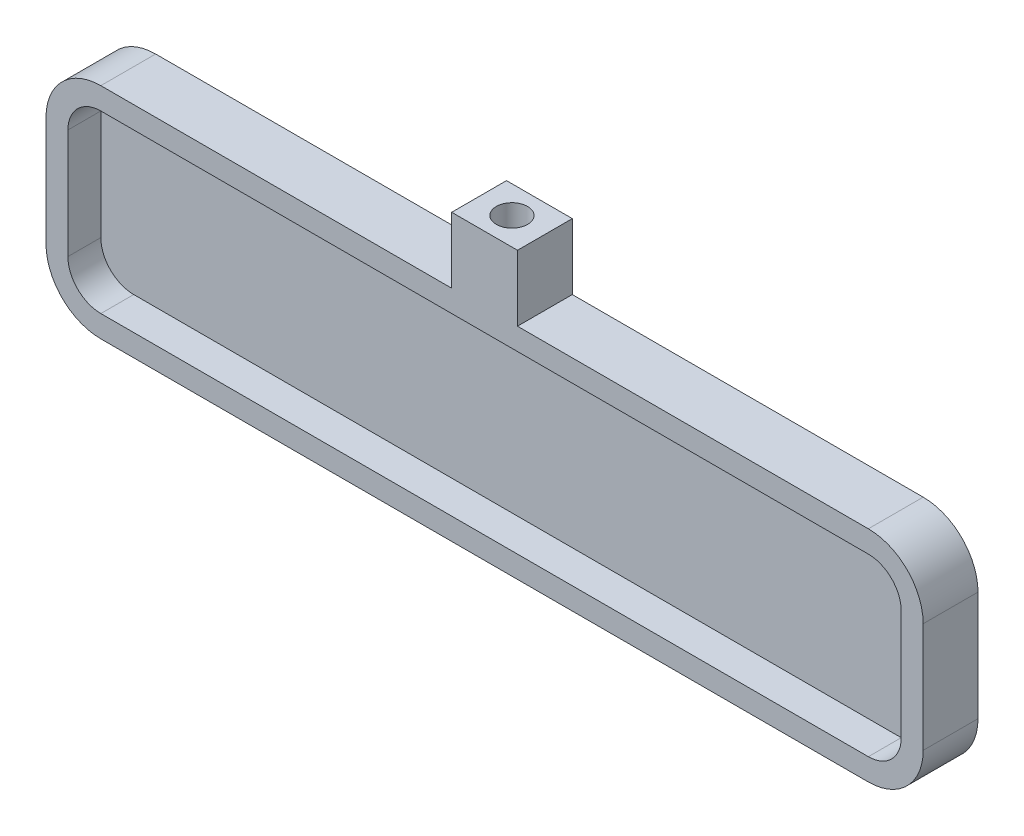
ISO-10303-21;
HEADER;
FILE_DESCRIPTION(('STEP AP214'),'2;1');
FILE_NAME('part.step','',(''),(''),'','','');
FILE_SCHEMA(('AUTOMOTIVE_DESIGN { 1 0 10303 214 1 1 1 1 }'));
ENDSEC;
DATA;
#1=APPLICATION_CONTEXT('core data for automotive mechanical design processes');
#2=APPLICATION_PROTOCOL_DEFINITION('international standard','automotive_design',2000,#1);
#3=PRODUCT_CONTEXT('',#1,'mechanical');
#4=PRODUCT('Part','Part','',(#3));
#5=PRODUCT_RELATED_PRODUCT_CATEGORY('part','',(#4));
#6=PRODUCT_DEFINITION_FORMATION('','',#4);
#7=PRODUCT_DEFINITION_CONTEXT('part definition',#1,'design');
#8=PRODUCT_DEFINITION('design','',#6,#7);
#9=PRODUCT_DEFINITION_SHAPE('','',#8);
#10=(LENGTH_UNIT() NAMED_UNIT(*) SI_UNIT(.MILLI.,.METRE.));
#11=(NAMED_UNIT(*) PLANE_ANGLE_UNIT() SI_UNIT($,.RADIAN.));
#12=(NAMED_UNIT(*) SI_UNIT($,.STERADIAN.) SOLID_ANGLE_UNIT());
#13=UNCERTAINTY_MEASURE_WITH_UNIT(LENGTH_MEASURE(1.E-05),#10,'distance_accuracy_value','');
#14=(GEOMETRIC_REPRESENTATION_CONTEXT(3) GLOBAL_UNCERTAINTY_ASSIGNED_CONTEXT((#13)) GLOBAL_UNIT_ASSIGNED_CONTEXT((#10,
#11,#12)) REPRESENTATION_CONTEXT('',''));
#15=CARTESIAN_POINT('',(0.,0.,0.));
#16=DIRECTION('',(0.,0.,1.));
#17=DIRECTION('',(1.,0.,0.));
#18=AXIS2_PLACEMENT_3D('',#15,#16,#17);
#19=CARTESIAN_POINT('',(-40.,10.,5.));
#20=DIRECTION('',(0.,-1.,0.));
#21=DIRECTION('',(0.,0.,-1.));
#22=AXIS2_PLACEMENT_3D('',#19,#20,#21);
#23=PLANE('',#22);
#24=DIRECTION('',(0.,0.,1.));
#25=VECTOR('',#24,1.);
#26=CARTESIAN_POINT('',(-3.,10.,5.));
#27=LINE('',#26,#25);
#28=CARTESIAN_POINT('',(-3.,10.,0.));
#29=VERTEX_POINT('',#28);
#30=CARTESIAN_POINT('',(-3.,10.,5.));
#31=VERTEX_POINT('',#30);
#32=EDGE_CURVE('E196',#29,#31,#27,.T.);
#33=ORIENTED_EDGE('',*,*,#32,.F.);
#34=DIRECTION('',(-1.,0.,0.));
#35=VECTOR('',#34,1.);
#36=CARTESIAN_POINT('',(-40.,10.,0.));
#37=LINE('',#36,#35);
#38=CARTESIAN_POINT('',(-35.,10.,0.));
#39=VERTEX_POINT('',#38);
#40=EDGE_CURVE('E277',#29,#39,#37,.T.);
#41=ORIENTED_EDGE('',*,*,#40,.T.);
#42=DIRECTION('',(0.,0.,-1.));
#43=VECTOR('',#42,1.);
#44=CARTESIAN_POINT('',(-35.,10.,5.));
#45=LINE('',#44,#43);
#46=CARTESIAN_POINT('',(-35.,10.,5.));
#47=VERTEX_POINT('',#46);
#48=EDGE_CURVE('E274',#39,#47,#45,.F.);
#49=ORIENTED_EDGE('',*,*,#48,.T.);
#50=DIRECTION('',(-1.,0.,0.));
#51=VECTOR('',#50,1.);
#52=CARTESIAN_POINT('',(-40.,10.,5.));
#53=LINE('',#52,#51);
#54=EDGE_CURVE('E51',#31,#47,#53,.T.);
#55=ORIENTED_EDGE('',*,*,#54,.F.);
#56=EDGE_LOOP('',(#33,#41,#49,#55));
#57=FACE_BOUND('',#56,.T.);
#58=ADVANCED_FACE('F36',(#57),#23,.F.);
#59=DIRECTION('',(0.,0.,-1.));
#60=VECTOR('',#59,1.);
#61=CARTESIAN_POINT('',(3.,10.,5.));
#62=LINE('',#61,#60);
#63=CARTESIAN_POINT('',(3.,10.,5.));
#64=VERTEX_POINT('',#63);
#65=CARTESIAN_POINT('',(3.,10.,0.));
#66=VERTEX_POINT('',#65);
#67=EDGE_CURVE('E59',#64,#66,#62,.T.);
#68=ORIENTED_EDGE('',*,*,#67,.F.);
#69=CARTESIAN_POINT('',(35.,10.,5.));
#70=VERTEX_POINT('',#69);
#71=EDGE_CURVE('E266',#70,#64,#53,.T.);
#72=ORIENTED_EDGE('',*,*,#71,.F.);
#73=DIRECTION('',(0.,0.,-1.));
#74=VECTOR('',#73,1.);
#75=CARTESIAN_POINT('',(35.,10.,5.));
#76=LINE('',#75,#74);
#77=CARTESIAN_POINT('',(35.,10.,0.));
#78=VERTEX_POINT('',#77);
#79=EDGE_CURVE('E286',#70,#78,#76,.T.);
#80=ORIENTED_EDGE('',*,*,#79,.T.);
#81=EDGE_CURVE('E278',#78,#66,#37,.T.);
#82=ORIENTED_EDGE('',*,*,#81,.T.);
#83=EDGE_LOOP('',(#68,#72,#80,#82));
#84=FACE_BOUND('',#83,.T.);
#85=ADVANCED_FACE('F351',(#84),#23,.F.);
#86=CARTESIAN_POINT('',(40.,10.,5.));
#87=DIRECTION('',(-1.,0.,0.));
#88=DIRECTION('',(0.,0.,1.));
#89=AXIS2_PLACEMENT_3D('',#86,#87,#88);
#90=PLANE('',#89);
#91=DIRECTION('',(0.,1.,0.));
#92=VECTOR('',#91,1.);
#93=CARTESIAN_POINT('',(40.,10.,0.));
#94=LINE('',#93,#92);
#95=CARTESIAN_POINT('',(40.,-5.,0.));
#96=VERTEX_POINT('',#95);
#97=CARTESIAN_POINT('',(40.,5.,0.));
#98=VERTEX_POINT('',#97);
#99=EDGE_CURVE('E241',#96,#98,#94,.T.);
#100=ORIENTED_EDGE('',*,*,#99,.T.);
#101=DIRECTION('',(0.,0.,-1.));
#102=VECTOR('',#101,1.);
#103=CARTESIAN_POINT('',(40.,5.,5.));
#104=LINE('',#103,#102);
#105=CARTESIAN_POINT('',(40.,5.,5.));
#106=VERTEX_POINT('',#105);
#107=EDGE_CURVE('E301',#98,#106,#104,.F.);
#108=ORIENTED_EDGE('',*,*,#107,.T.);
#109=DIRECTION('',(0.,1.,0.));
#110=VECTOR('',#109,1.);
#111=CARTESIAN_POINT('',(40.,10.,5.));
#112=LINE('',#111,#110);
#113=CARTESIAN_POINT('',(40.,-5.,5.));
#114=VERTEX_POINT('',#113);
#115=EDGE_CURVE('E263',#114,#106,#112,.T.);
#116=ORIENTED_EDGE('',*,*,#115,.F.);
#117=DIRECTION('',(0.,0.,-1.));
#118=VECTOR('',#117,1.);
#119=CARTESIAN_POINT('',(40.,-5.,5.));
#120=LINE('',#119,#118);
#121=EDGE_CURVE('E298',#114,#96,#120,.T.);
#122=ORIENTED_EDGE('',*,*,#121,.T.);
#123=EDGE_LOOP('',(#100,#108,#116,#122));
#124=FACE_BOUND('',#123,.T.);
#125=ADVANCED_FACE('F344',(#124),#90,.F.);
#126=CARTESIAN_POINT('',(-40.,10.,5.));
#127=DIRECTION('',(1.,0.,0.));
#128=DIRECTION('',(0.,0.,-1.));
#129=AXIS2_PLACEMENT_3D('',#126,#127,#128);
#130=PLANE('',#129);
#131=DIRECTION('',(0.,-1.,0.));
#132=VECTOR('',#131,1.);
#133=CARTESIAN_POINT('',(-40.,10.,0.));
#134=LINE('',#133,#132);
#135=CARTESIAN_POINT('',(-40.,5.,0.));
#136=VERTEX_POINT('',#135);
#137=CARTESIAN_POINT('',(-40.,-5.,0.));
#138=VERTEX_POINT('',#137);
#139=EDGE_CURVE('E280',#136,#138,#134,.T.);
#140=ORIENTED_EDGE('',*,*,#139,.T.);
#141=DIRECTION('',(0.,0.,-1.));
#142=VECTOR('',#141,1.);
#143=CARTESIAN_POINT('',(-40.,-5.,5.));
#144=LINE('',#143,#142);
#145=CARTESIAN_POINT('',(-40.,-5.,5.));
#146=VERTEX_POINT('',#145);
#147=EDGE_CURVE('E11',#138,#146,#144,.F.);
#148=ORIENTED_EDGE('',*,*,#147,.T.);
#149=DIRECTION('',(0.,-1.,0.));
#150=VECTOR('',#149,1.);
#151=CARTESIAN_POINT('',(-40.,10.,5.));
#152=LINE('',#151,#150);
#153=CARTESIAN_POINT('',(-40.,5.,5.));
#154=VERTEX_POINT('',#153);
#155=EDGE_CURVE('E268',#154,#146,#152,.T.);
#156=ORIENTED_EDGE('',*,*,#155,.F.);
#157=DIRECTION('',(0.,0.,-1.));
#158=VECTOR('',#157,1.);
#159=CARTESIAN_POINT('',(-40.,5.,5.));
#160=LINE('',#159,#158);
#161=EDGE_CURVE('E44',#154,#136,#160,.T.);
#162=ORIENTED_EDGE('',*,*,#161,.T.);
#163=EDGE_LOOP('',(#140,#148,#156,#162));
#164=FACE_BOUND('',#163,.T.);
#165=ADVANCED_FACE('F320',(#164),#130,.F.);
#166=CARTESIAN_POINT('',(-40.,-10.,5.));
#167=DIRECTION('',(0.,1.,0.));
#168=DIRECTION('',(0.,0.,1.));
#169=AXIS2_PLACEMENT_3D('',#166,#167,#168);
#170=PLANE('',#169);
#171=DIRECTION('',(1.,0.,0.));
#172=VECTOR('',#171,1.);
#173=CARTESIAN_POINT('',(-40.,-10.,0.));
#174=LINE('',#173,#172);
#175=CARTESIAN_POINT('',(-35.,-10.,0.));
#176=VERTEX_POINT('',#175);
#177=CARTESIAN_POINT('',(35.,-10.,0.));
#178=VERTEX_POINT('',#177);
#179=EDGE_CURVE('E265',#176,#178,#174,.T.);
#180=ORIENTED_EDGE('',*,*,#179,.T.);
#181=DIRECTION('',(0.,0.,-1.));
#182=VECTOR('',#181,1.);
#183=CARTESIAN_POINT('',(35.,-10.,5.));
#184=LINE('',#183,#182);
#185=CARTESIAN_POINT('',(35.,-10.,5.));
#186=VERTEX_POINT('',#185);
#187=EDGE_CURVE('E314',#178,#186,#184,.F.);
#188=ORIENTED_EDGE('',*,*,#187,.T.);
#189=DIRECTION('',(1.,0.,0.));
#190=VECTOR('',#189,1.);
#191=CARTESIAN_POINT('',(-40.,-10.,5.));
#192=LINE('',#191,#190);
#193=CARTESIAN_POINT('',(-35.,-10.,5.));
#194=VERTEX_POINT('',#193);
#195=EDGE_CURVE('E271',#194,#186,#192,.T.);
#196=ORIENTED_EDGE('',*,*,#195,.F.);
#197=DIRECTION('',(0.,0.,-1.));
#198=VECTOR('',#197,1.);
#199=CARTESIAN_POINT('',(-35.,-10.,5.));
#200=LINE('',#199,#198);
#201=EDGE_CURVE('E311',#194,#176,#200,.T.);
#202=ORIENTED_EDGE('',*,*,#201,.T.);
#203=EDGE_LOOP('',(#180,#188,#196,#202));
#204=FACE_BOUND('',#203,.T.);
#205=ADVANCED_FACE('F335',(#204),#170,.F.);
#206=CARTESIAN_POINT('',(0.,0.,5.));
#207=DIRECTION('',(0.,0.,1.));
#208=DIRECTION('',(1.,0.,0.));
#209=AXIS2_PLACEMENT_3D('',#206,#207,#208);
#210=PLANE('',#209);
#211=DIRECTION('',(0.,1.,0.));
#212=VECTOR('',#211,1.);
#213=CARTESIAN_POINT('',(38.,10.,5.));
#214=LINE('',#213,#212);
#215=CARTESIAN_POINT('',(38.,-5.,5.));
#216=VERTEX_POINT('',#215);
#217=CARTESIAN_POINT('',(38.,5.,5.));
#218=VERTEX_POINT('',#217);
#219=EDGE_CURVE('E223',#216,#218,#214,.T.);
#220=ORIENTED_EDGE('',*,*,#219,.F.);
#221=CARTESIAN_POINT('',(35.,-5.,5.));
#222=DIRECTION('',(0.,0.,1.));
#223=DIRECTION('',(1.,0.,0.));
#224=AXIS2_PLACEMENT_3D('',#221,#222,#223);
#225=CIRCLE('',#224,3.);
#226=CARTESIAN_POINT('',(35.,-8.,5.));
#227=VERTEX_POINT('',#226);
#228=EDGE_CURVE('E252',#227,#216,#225,.T.);
#229=ORIENTED_EDGE('',*,*,#228,.F.);
#230=DIRECTION('',(1.,0.,0.));
#231=VECTOR('',#230,1.);
#232=CARTESIAN_POINT('',(-40.,-8.,5.));
#233=LINE('',#232,#231);
#234=CARTESIAN_POINT('',(-35.,-8.,5.));
#235=VERTEX_POINT('',#234);
#236=EDGE_CURVE('E234',#235,#227,#233,.T.);
#237=ORIENTED_EDGE('',*,*,#236,.F.);
#238=CARTESIAN_POINT('',(-35.,-5.,5.));
#239=DIRECTION('',(0.,0.,1.));
#240=DIRECTION('',(1.,0.,0.));
#241=AXIS2_PLACEMENT_3D('',#238,#239,#240);
#242=CIRCLE('',#241,3.);
#243=CARTESIAN_POINT('',(-38.,-5.,5.));
#244=VERTEX_POINT('',#243);
#245=EDGE_CURVE('E257',#244,#235,#242,.T.);
#246=ORIENTED_EDGE('',*,*,#245,.F.);
#247=DIRECTION('',(0.,-1.,0.));
#248=VECTOR('',#247,1.);
#249=CARTESIAN_POINT('',(-38.,10.,5.));
#250=LINE('',#249,#248);
#251=CARTESIAN_POINT('',(-38.,5.,5.));
#252=VERTEX_POINT('',#251);
#253=EDGE_CURVE('E255',#252,#244,#250,.T.);
#254=ORIENTED_EDGE('',*,*,#253,.F.);
#255=CARTESIAN_POINT('',(-35.,5.,5.));
#256=DIRECTION('',(0.,0.,1.));
#257=DIRECTION('',(1.,0.,0.));
#258=AXIS2_PLACEMENT_3D('',#255,#256,#257);
#259=CIRCLE('',#258,3.);
#260=CARTESIAN_POINT('',(-35.,8.,5.));
#261=VERTEX_POINT('',#260);
#262=EDGE_CURVE('E208',#261,#252,#259,.T.);
#263=ORIENTED_EDGE('',*,*,#262,.F.);
#264=DIRECTION('',(-1.,0.,0.));
#265=VECTOR('',#264,1.);
#266=CARTESIAN_POINT('',(-40.,8.,5.));
#267=LINE('',#266,#265);
#268=CARTESIAN_POINT('',(35.,8.,5.));
#269=VERTEX_POINT('',#268);
#270=EDGE_CURVE('E250',#269,#261,#267,.T.);
#271=ORIENTED_EDGE('',*,*,#270,.F.);
#272=CARTESIAN_POINT('',(35.,5.,5.));
#273=DIRECTION('',(0.,0.,1.));
#274=DIRECTION('',(1.,0.,0.));
#275=AXIS2_PLACEMENT_3D('',#272,#273,#274);
#276=CIRCLE('',#275,3.);
#277=EDGE_CURVE('E245',#218,#269,#276,.T.);
#278=ORIENTED_EDGE('',*,*,#277,.F.);
#279=EDGE_LOOP('',(#220,#229,#237,#246,#254,#263,#271,#278));
#280=FACE_BOUND('',#279,.T.);
#281=ORIENTED_EDGE('',*,*,#115,.T.);
#282=CARTESIAN_POINT('',(35.,5.,5.));
#283=DIRECTION('',(0.,0.,1.));
#284=DIRECTION('',(1.,0.,0.));
#285=AXIS2_PLACEMENT_3D('',#282,#283,#284);
#286=CIRCLE('',#285,5.);
#287=EDGE_CURVE('E309',#106,#70,#286,.T.);
#288=ORIENTED_EDGE('',*,*,#287,.T.);
#289=ORIENTED_EDGE('',*,*,#71,.T.);
#290=DIRECTION('',(0.,-1.,0.));
#291=VECTOR('',#290,1.);
#292=CARTESIAN_POINT('',(3.,16.,5.));
#293=LINE('',#292,#291);
#294=CARTESIAN_POINT('',(3.,16.,5.));
#295=VERTEX_POINT('',#294);
#296=EDGE_CURVE('E181',#295,#64,#293,.T.);
#297=ORIENTED_EDGE('',*,*,#296,.F.);
#298=DIRECTION('',(1.,0.,0.));
#299=VECTOR('',#298,1.);
#300=CARTESIAN_POINT('',(3.,16.,5.));
#301=LINE('',#300,#299);
#302=CARTESIAN_POINT('',(-3.,16.,5.));
#303=VERTEX_POINT('',#302);
#304=EDGE_CURVE('E173',#303,#295,#301,.T.);
#305=ORIENTED_EDGE('',*,*,#304,.F.);
#306=DIRECTION('',(0.,-1.,0.));
#307=VECTOR('',#306,1.);
#308=CARTESIAN_POINT('',(-3.,16.,5.));
#309=LINE('',#308,#307);
#310=EDGE_CURVE('E178',#303,#31,#309,.T.);
#311=ORIENTED_EDGE('',*,*,#310,.T.);
#312=ORIENTED_EDGE('',*,*,#54,.T.);
#313=CARTESIAN_POINT('',(-35.,5.,5.));
#314=DIRECTION('',(0.,0.,1.));
#315=DIRECTION('',(1.,0.,0.));
#316=AXIS2_PLACEMENT_3D('',#313,#314,#315);
#317=CIRCLE('',#316,5.);
#318=EDGE_CURVE('E303',#47,#154,#317,.T.);
#319=ORIENTED_EDGE('',*,*,#318,.T.);
#320=ORIENTED_EDGE('',*,*,#155,.T.);
#321=CARTESIAN_POINT('',(-35.,-5.,5.));
#322=DIRECTION('',(0.,0.,1.));
#323=DIRECTION('',(1.,0.,0.));
#324=AXIS2_PLACEMENT_3D('',#321,#322,#323);
#325=CIRCLE('',#324,5.);
#326=EDGE_CURVE('E305',#146,#194,#325,.T.);
#327=ORIENTED_EDGE('',*,*,#326,.T.);
#328=ORIENTED_EDGE('',*,*,#195,.T.);
#329=CARTESIAN_POINT('',(35.,-5.,5.));
#330=DIRECTION('',(0.,0.,1.));
#331=DIRECTION('',(1.,0.,0.));
#332=AXIS2_PLACEMENT_3D('',#329,#330,#331);
#333=CIRCLE('',#332,5.);
#334=EDGE_CURVE('E307',#186,#114,#333,.T.);
#335=ORIENTED_EDGE('',*,*,#334,.T.);
#336=EDGE_LOOP('',(#281,#288,#289,#297,#305,#311,#312,#319,#320,#327,#328,#335));
#337=FACE_BOUND('',#336,.T.);
#338=ADVANCED_FACE('F176',(#280,#337),#210,.T.);
#339=CARTESIAN_POINT('',(0.,0.,0.));
#340=DIRECTION('',(0.,0.,1.));
#341=DIRECTION('',(1.,0.,0.));
#342=AXIS2_PLACEMENT_3D('',#339,#340,#341);
#343=PLANE('',#342);
#344=ORIENTED_EDGE('',*,*,#81,.F.);
#345=CARTESIAN_POINT('',(35.,5.,0.));
#346=DIRECTION('',(0.,0.,1.));
#347=DIRECTION('',(1.,0.,0.));
#348=AXIS2_PLACEMENT_3D('',#345,#346,#347);
#349=CIRCLE('',#348,5.);
#350=EDGE_CURVE('E296',#78,#98,#349,.F.);
#351=ORIENTED_EDGE('',*,*,#350,.T.);
#352=ORIENTED_EDGE('',*,*,#99,.F.);
#353=CARTESIAN_POINT('',(35.,-5.,0.));
#354=DIRECTION('',(0.,0.,1.));
#355=DIRECTION('',(1.,0.,0.));
#356=AXIS2_PLACEMENT_3D('',#353,#354,#355);
#357=CIRCLE('',#356,5.);
#358=EDGE_CURVE('E294',#96,#178,#357,.F.);
#359=ORIENTED_EDGE('',*,*,#358,.T.);
#360=ORIENTED_EDGE('',*,*,#179,.F.);
#361=CARTESIAN_POINT('',(-35.,-5.,0.));
#362=DIRECTION('',(0.,0.,1.));
#363=DIRECTION('',(1.,0.,0.));
#364=AXIS2_PLACEMENT_3D('',#361,#362,#363);
#365=CIRCLE('',#364,5.);
#366=EDGE_CURVE('E292',#176,#138,#365,.F.);
#367=ORIENTED_EDGE('',*,*,#366,.T.);
#368=ORIENTED_EDGE('',*,*,#139,.F.);
#369=CARTESIAN_POINT('',(-35.,5.,0.));
#370=DIRECTION('',(0.,0.,1.));
#371=DIRECTION('',(1.,0.,0.));
#372=AXIS2_PLACEMENT_3D('',#369,#370,#371);
#373=CIRCLE('',#372,5.);
#374=EDGE_CURVE('E289',#136,#39,#373,.F.);
#375=ORIENTED_EDGE('',*,*,#374,.T.);
#376=ORIENTED_EDGE('',*,*,#40,.F.);
#377=DIRECTION('',(0.,-1.,0.));
#378=VECTOR('',#377,1.);
#379=CARTESIAN_POINT('',(-3.,16.,0.));
#380=LINE('',#379,#378);
#381=CARTESIAN_POINT('',(-3.,16.,0.));
#382=VERTEX_POINT('',#381);
#383=EDGE_CURVE('E356',#382,#29,#380,.T.);
#384=ORIENTED_EDGE('',*,*,#383,.F.);
#385=DIRECTION('',(-1.,0.,0.));
#386=VECTOR('',#385,1.);
#387=CARTESIAN_POINT('',(3.,16.,0.));
#388=LINE('',#387,#386);
#389=CARTESIAN_POINT('',(3.,16.,0.));
#390=VERTEX_POINT('',#389);
#391=EDGE_CURVE('E190',#390,#382,#388,.T.);
#392=ORIENTED_EDGE('',*,*,#391,.F.);
#393=DIRECTION('',(0.,-1.,0.));
#394=VECTOR('',#393,1.);
#395=CARTESIAN_POINT('',(3.,16.,0.));
#396=LINE('',#395,#394);
#397=EDGE_CURVE('E202',#390,#66,#396,.T.);
#398=ORIENTED_EDGE('',*,*,#397,.T.);
#399=EDGE_LOOP('',(#344,#351,#352,#359,#360,#367,#368,#375,#376,#384,#392,#398));
#400=FACE_BOUND('',#399,.T.);
#401=ADVANCED_FACE('F326',(#400),#343,.F.);
#402=CARTESIAN_POINT('',(35.,5.,5.));
#403=DIRECTION('',(0.,0.,-1.));
#404=DIRECTION('',(-1.,0.,0.));
#405=AXIS2_PLACEMENT_3D('',#402,#403,#404);
#406=CYLINDRICAL_SURFACE('',#405,5.);
#407=ORIENTED_EDGE('',*,*,#287,.F.);
#408=ORIENTED_EDGE('',*,*,#107,.F.);
#409=ORIENTED_EDGE('',*,*,#350,.F.);
#410=ORIENTED_EDGE('',*,*,#79,.F.);
#411=EDGE_LOOP('',(#407,#408,#409,#410));
#412=FACE_BOUND('',#411,.T.);
#413=ADVANCED_FACE('F350',(#412),#406,.T.);
#414=CARTESIAN_POINT('',(35.,-5.,5.));
#415=DIRECTION('',(0.,0.,-1.));
#416=DIRECTION('',(-1.,0.,0.));
#417=AXIS2_PLACEMENT_3D('',#414,#415,#416);
#418=CYLINDRICAL_SURFACE('',#417,5.);
#419=ORIENTED_EDGE('',*,*,#334,.F.);
#420=ORIENTED_EDGE('',*,*,#187,.F.);
#421=ORIENTED_EDGE('',*,*,#358,.F.);
#422=ORIENTED_EDGE('',*,*,#121,.F.);
#423=EDGE_LOOP('',(#419,#420,#421,#422));
#424=FACE_BOUND('',#423,.T.);
#425=ADVANCED_FACE('F341',(#424),#418,.T.);
#426=CARTESIAN_POINT('',(-35.,-5.,5.));
#427=DIRECTION('',(0.,0.,-1.));
#428=DIRECTION('',(-1.,0.,0.));
#429=AXIS2_PLACEMENT_3D('',#426,#427,#428);
#430=CYLINDRICAL_SURFACE('',#429,5.);
#431=ORIENTED_EDGE('',*,*,#326,.F.);
#432=ORIENTED_EDGE('',*,*,#147,.F.);
#433=ORIENTED_EDGE('',*,*,#366,.F.);
#434=ORIENTED_EDGE('',*,*,#201,.F.);
#435=EDGE_LOOP('',(#431,#432,#433,#434));
#436=FACE_BOUND('',#435,.T.);
#437=ADVANCED_FACE('F332',(#436),#430,.T.);
#438=CARTESIAN_POINT('',(-35.,5.,5.));
#439=DIRECTION('',(0.,0.,-1.));
#440=DIRECTION('',(-1.,0.,0.));
#441=AXIS2_PLACEMENT_3D('',#438,#439,#440);
#442=CYLINDRICAL_SURFACE('',#441,5.);
#443=ORIENTED_EDGE('',*,*,#318,.F.);
#444=ORIENTED_EDGE('',*,*,#48,.F.);
#445=ORIENTED_EDGE('',*,*,#374,.F.);
#446=ORIENTED_EDGE('',*,*,#161,.F.);
#447=EDGE_LOOP('',(#443,#444,#445,#446));
#448=FACE_BOUND('',#447,.T.);
#449=ADVANCED_FACE('F38',(#448),#442,.T.);
#450=CARTESIAN_POINT('',(38.,10.,5.));
#451=DIRECTION('',(-1.,0.,0.));
#452=DIRECTION('',(0.,0.,1.));
#453=AXIS2_PLACEMENT_3D('',#450,#451,#452);
#454=PLANE('',#453);
#455=DIRECTION('',(0.,1.,0.));
#456=VECTOR('',#455,1.);
#457=CARTESIAN_POINT('',(38.,10.,2.));
#458=LINE('',#457,#456);
#459=CARTESIAN_POINT('',(38.,-5.,2.));
#460=VERTEX_POINT('',#459);
#461=CARTESIAN_POINT('',(38.,5.,2.));
#462=VERTEX_POINT('',#461);
#463=EDGE_CURVE('E197',#460,#462,#458,.T.);
#464=ORIENTED_EDGE('',*,*,#463,.F.);
#465=DIRECTION('',(0.,0.,1.));
#466=VECTOR('',#465,1.);
#467=CARTESIAN_POINT('',(38.,-5.,5.));
#468=LINE('',#467,#466);
#469=EDGE_CURVE('E209',#216,#460,#468,.F.);
#470=ORIENTED_EDGE('',*,*,#469,.F.);
#471=ORIENTED_EDGE('',*,*,#219,.T.);
#472=DIRECTION('',(0.,0.,1.));
#473=VECTOR('',#472,1.);
#474=CARTESIAN_POINT('',(38.,5.,5.));
#475=LINE('',#474,#473);
#476=EDGE_CURVE('E206',#462,#218,#475,.T.);
#477=ORIENTED_EDGE('',*,*,#476,.F.);
#478=EDGE_LOOP('',(#464,#470,#471,#477));
#479=FACE_BOUND('',#478,.T.);
#480=ADVANCED_FACE('F379',(#479),#454,.T.);
#481=CARTESIAN_POINT('',(-40.,8.,5.));
#482=DIRECTION('',(0.,-1.,0.));
#483=DIRECTION('',(0.,0.,-1.));
#484=AXIS2_PLACEMENT_3D('',#481,#482,#483);
#485=PLANE('',#484);
#486=ORIENTED_EDGE('',*,*,#270,.T.);
#487=DIRECTION('',(0.,0.,-1.));
#488=VECTOR('',#487,1.);
#489=CARTESIAN_POINT('',(-35.,8.,5.));
#490=LINE('',#489,#488);
#491=CARTESIAN_POINT('',(-35.,8.,2.));
#492=VERTEX_POINT('',#491);
#493=EDGE_CURVE('E232',#492,#261,#490,.F.);
#494=ORIENTED_EDGE('',*,*,#493,.F.);
#495=DIRECTION('',(-1.,0.,0.));
#496=VECTOR('',#495,1.);
#497=CARTESIAN_POINT('',(-40.,8.,2.));
#498=LINE('',#497,#496);
#499=CARTESIAN_POINT('',(35.,8.,2.));
#500=VERTEX_POINT('',#499);
#501=EDGE_CURVE('E200',#500,#492,#498,.T.);
#502=ORIENTED_EDGE('',*,*,#501,.F.);
#503=DIRECTION('',(0.,0.,-1.));
#504=VECTOR('',#503,1.);
#505=CARTESIAN_POINT('',(35.,8.,5.));
#506=LINE('',#505,#504);
#507=EDGE_CURVE('E229',#269,#500,#506,.T.);
#508=ORIENTED_EDGE('',*,*,#507,.F.);
#509=EDGE_LOOP('',(#486,#494,#502,#508));
#510=FACE_BOUND('',#509,.T.);
#511=ADVANCED_FACE('F383',(#510),#485,.T.);
#512=CARTESIAN_POINT('',(-38.,10.,5.));
#513=DIRECTION('',(1.,0.,0.));
#514=DIRECTION('',(0.,0.,-1.));
#515=AXIS2_PLACEMENT_3D('',#512,#513,#514);
#516=PLANE('',#515);
#517=DIRECTION('',(0.,-1.,0.));
#518=VECTOR('',#517,1.);
#519=CARTESIAN_POINT('',(-38.,10.,2.));
#520=LINE('',#519,#518);
#521=CARTESIAN_POINT('',(-38.,5.,2.));
#522=VERTEX_POINT('',#521);
#523=CARTESIAN_POINT('',(-38.,-5.,2.));
#524=VERTEX_POINT('',#523);
#525=EDGE_CURVE('E215',#522,#524,#520,.T.);
#526=ORIENTED_EDGE('',*,*,#525,.F.);
#527=DIRECTION('',(0.,0.,-1.));
#528=VECTOR('',#527,1.);
#529=CARTESIAN_POINT('',(-38.,5.,5.));
#530=LINE('',#529,#528);
#531=EDGE_CURVE('E235',#252,#522,#530,.T.);
#532=ORIENTED_EDGE('',*,*,#531,.F.);
#533=ORIENTED_EDGE('',*,*,#253,.T.);
#534=DIRECTION('',(0.,0.,-1.));
#535=VECTOR('',#534,1.);
#536=CARTESIAN_POINT('',(-38.,-5.,5.));
#537=LINE('',#536,#535);
#538=EDGE_CURVE('E238',#524,#244,#537,.F.);
#539=ORIENTED_EDGE('',*,*,#538,.F.);
#540=EDGE_LOOP('',(#526,#532,#533,#539));
#541=FACE_BOUND('',#540,.T.);
#542=ADVANCED_FACE('F389',(#541),#516,.T.);
#543=CARTESIAN_POINT('',(-40.,-8.,5.));
#544=DIRECTION('',(0.,1.,0.));
#545=DIRECTION('',(0.,0.,1.));
#546=AXIS2_PLACEMENT_3D('',#543,#544,#545);
#547=PLANE('',#546);
#548=DIRECTION('',(1.,0.,0.));
#549=VECTOR('',#548,1.);
#550=CARTESIAN_POINT('',(-40.,-8.,2.));
#551=LINE('',#550,#549);
#552=CARTESIAN_POINT('',(-35.,-8.,2.));
#553=VERTEX_POINT('',#552);
#554=CARTESIAN_POINT('',(35.,-8.,2.));
#555=VERTEX_POINT('',#554);
#556=EDGE_CURVE('E220',#553,#555,#551,.T.);
#557=ORIENTED_EDGE('',*,*,#556,.F.);
#558=DIRECTION('',(0.,0.,1.));
#559=VECTOR('',#558,1.);
#560=CARTESIAN_POINT('',(-35.,-8.,5.));
#561=LINE('',#560,#559);
#562=EDGE_CURVE('E242',#235,#553,#561,.F.);
#563=ORIENTED_EDGE('',*,*,#562,.F.);
#564=ORIENTED_EDGE('',*,*,#236,.T.);
#565=DIRECTION('',(0.,0.,1.));
#566=VECTOR('',#565,1.);
#567=CARTESIAN_POINT('',(35.,-8.,5.));
#568=LINE('',#567,#566);
#569=EDGE_CURVE('E239',#555,#227,#568,.T.);
#570=ORIENTED_EDGE('',*,*,#569,.F.);
#571=EDGE_LOOP('',(#557,#563,#564,#570));
#572=FACE_BOUND('',#571,.T.);
#573=ADVANCED_FACE('F398',(#572),#547,.T.);
#574=CARTESIAN_POINT('',(0.,0.,2.));
#575=DIRECTION('',(0.,0.,1.));
#576=DIRECTION('',(1.,0.,0.));
#577=AXIS2_PLACEMENT_3D('',#574,#575,#576);
#578=PLANE('',#577);
#579=ORIENTED_EDGE('',*,*,#501,.T.);
#580=CARTESIAN_POINT('',(-35.,5.,2.));
#581=DIRECTION('',(0.,0.,1.));
#582=DIRECTION('',(1.,0.,0.));
#583=AXIS2_PLACEMENT_3D('',#580,#581,#582);
#584=CIRCLE('',#583,3.);
#585=EDGE_CURVE('E225',#522,#492,#584,.F.);
#586=ORIENTED_EDGE('',*,*,#585,.F.);
#587=ORIENTED_EDGE('',*,*,#525,.T.);
#588=CARTESIAN_POINT('',(-35.,-5.,2.));
#589=DIRECTION('',(0.,0.,1.));
#590=DIRECTION('',(1.,0.,0.));
#591=AXIS2_PLACEMENT_3D('',#588,#589,#590);
#592=CIRCLE('',#591,3.);
#593=EDGE_CURVE('E219',#553,#524,#592,.F.);
#594=ORIENTED_EDGE('',*,*,#593,.F.);
#595=ORIENTED_EDGE('',*,*,#556,.T.);
#596=CARTESIAN_POINT('',(35.,-5.,2.));
#597=DIRECTION('',(0.,0.,1.));
#598=DIRECTION('',(1.,0.,0.));
#599=AXIS2_PLACEMENT_3D('',#596,#597,#598);
#600=CIRCLE('',#599,3.);
#601=EDGE_CURVE('E217',#460,#555,#600,.F.);
#602=ORIENTED_EDGE('',*,*,#601,.F.);
#603=ORIENTED_EDGE('',*,*,#463,.T.);
#604=CARTESIAN_POINT('',(35.,5.,2.));
#605=DIRECTION('',(0.,0.,1.));
#606=DIRECTION('',(1.,0.,0.));
#607=AXIS2_PLACEMENT_3D('',#604,#605,#606);
#608=CIRCLE('',#607,3.);
#609=EDGE_CURVE('E212',#500,#462,#608,.F.);
#610=ORIENTED_EDGE('',*,*,#609,.F.);
#611=EDGE_LOOP('',(#579,#586,#587,#594,#595,#602,#603,#610));
#612=FACE_BOUND('',#611,.T.);
#613=ADVANCED_FACE('F402',(#612),#578,.T.);
#614=CARTESIAN_POINT('',(35.,5.,5.));
#615=DIRECTION('',(0.,0.,-1.));
#616=DIRECTION('',(-1.,0.,0.));
#617=AXIS2_PLACEMENT_3D('',#614,#615,#616);
#618=CYLINDRICAL_SURFACE('',#617,3.);
#619=ORIENTED_EDGE('',*,*,#277,.T.);
#620=ORIENTED_EDGE('',*,*,#507,.T.);
#621=ORIENTED_EDGE('',*,*,#609,.T.);
#622=ORIENTED_EDGE('',*,*,#476,.T.);
#623=EDGE_LOOP('',(#619,#620,#621,#622));
#624=FACE_BOUND('',#623,.T.);
#625=ADVANCED_FACE('F406',(#624),#618,.F.);
#626=CARTESIAN_POINT('',(35.,-5.,5.));
#627=DIRECTION('',(0.,0.,-1.));
#628=DIRECTION('',(-1.,0.,0.));
#629=AXIS2_PLACEMENT_3D('',#626,#627,#628);
#630=CYLINDRICAL_SURFACE('',#629,3.);
#631=ORIENTED_EDGE('',*,*,#228,.T.);
#632=ORIENTED_EDGE('',*,*,#469,.T.);
#633=ORIENTED_EDGE('',*,*,#601,.T.);
#634=ORIENTED_EDGE('',*,*,#569,.T.);
#635=EDGE_LOOP('',(#631,#632,#633,#634));
#636=FACE_BOUND('',#635,.T.);
#637=ADVANCED_FACE('F410',(#636),#630,.F.);
#638=CARTESIAN_POINT('',(-35.,-5.,5.));
#639=DIRECTION('',(0.,0.,-1.));
#640=DIRECTION('',(-1.,0.,0.));
#641=AXIS2_PLACEMENT_3D('',#638,#639,#640);
#642=CYLINDRICAL_SURFACE('',#641,3.);
#643=ORIENTED_EDGE('',*,*,#245,.T.);
#644=ORIENTED_EDGE('',*,*,#562,.T.);
#645=ORIENTED_EDGE('',*,*,#593,.T.);
#646=ORIENTED_EDGE('',*,*,#538,.T.);
#647=EDGE_LOOP('',(#643,#644,#645,#646));
#648=FACE_BOUND('',#647,.T.);
#649=ADVANCED_FACE('F414',(#648),#642,.F.);
#650=CARTESIAN_POINT('',(-35.,5.,5.));
#651=DIRECTION('',(0.,0.,-1.));
#652=DIRECTION('',(-1.,0.,0.));
#653=AXIS2_PLACEMENT_3D('',#650,#651,#652);
#654=CYLINDRICAL_SURFACE('',#653,3.);
#655=ORIENTED_EDGE('',*,*,#262,.T.);
#656=ORIENTED_EDGE('',*,*,#531,.T.);
#657=ORIENTED_EDGE('',*,*,#585,.T.);
#658=ORIENTED_EDGE('',*,*,#493,.T.);
#659=EDGE_LOOP('',(#655,#656,#657,#658));
#660=FACE_BOUND('',#659,.T.);
#661=ADVANCED_FACE('F418',(#660),#654,.F.);
#662=CARTESIAN_POINT('',(-3.,16.,5.));
#663=DIRECTION('',(1.,0.,0.));
#664=DIRECTION('',(0.,0.,-1.));
#665=AXIS2_PLACEMENT_3D('',#662,#663,#664);
#666=PLANE('',#665);
#667=ORIENTED_EDGE('',*,*,#32,.T.);
#668=ORIENTED_EDGE('',*,*,#310,.F.);
#669=DIRECTION('',(0.,0.,1.));
#670=VECTOR('',#669,1.);
#671=CARTESIAN_POINT('',(-3.,16.,5.));
#672=LINE('',#671,#670);
#673=EDGE_CURVE('E185',#382,#303,#672,.T.);
#674=ORIENTED_EDGE('',*,*,#673,.F.);
#675=ORIENTED_EDGE('',*,*,#383,.T.);
#676=EDGE_LOOP('',(#667,#668,#674,#675));
#677=FACE_BOUND('',#676,.T.);
#678=ADVANCED_FACE('F195',(#677),#666,.F.);
#679=CARTESIAN_POINT('',(3.,16.,5.));
#680=DIRECTION('',(-1.,0.,0.));
#681=DIRECTION('',(0.,0.,1.));
#682=AXIS2_PLACEMENT_3D('',#679,#680,#681);
#683=PLANE('',#682);
#684=ORIENTED_EDGE('',*,*,#67,.T.);
#685=ORIENTED_EDGE('',*,*,#397,.F.);
#686=DIRECTION('',(0.,0.,-1.));
#687=VECTOR('',#686,1.);
#688=CARTESIAN_POINT('',(3.,16.,5.));
#689=LINE('',#688,#687);
#690=EDGE_CURVE('E184',#295,#390,#689,.T.);
#691=ORIENTED_EDGE('',*,*,#690,.F.);
#692=ORIENTED_EDGE('',*,*,#296,.T.);
#693=EDGE_LOOP('',(#684,#685,#691,#692));
#694=FACE_BOUND('',#693,.T.);
#695=ADVANCED_FACE('F353',(#694),#683,.F.);
#696=CARTESIAN_POINT('',(0.,16.,0.));
#697=DIRECTION('',(0.,1.,0.));
#698=DIRECTION('',(0.,0.,1.));
#699=AXIS2_PLACEMENT_3D('',#696,#697,#698);
#700=PLANE('',#699);
#701=CARTESIAN_POINT('',(-0.00192903048379378,16.,2.50267214562427));
#702=DIRECTION('',(0.,1.,0.));
#703=DIRECTION('',(0.,0.,1.));
#704=AXIS2_PLACEMENT_3D('',#701,#702,#703);
#705=CIRCLE('',#704,1.425);
#706=CARTESIAN_POINT('',(-0.00192903048379378,16.,3.92767214562427));
#707=VERTEX_POINT('',#706);
#708=EDGE_CURVE('E600',#707,#707,#705,.T.);
#709=ORIENTED_EDGE('',*,*,#708,.F.);
#710=EDGE_LOOP('',(#709));
#711=FACE_BOUND('',#710,.T.);
#712=ORIENTED_EDGE('',*,*,#673,.T.);
#713=ORIENTED_EDGE('',*,*,#304,.T.);
#714=ORIENTED_EDGE('',*,*,#690,.T.);
#715=ORIENTED_EDGE('',*,*,#391,.T.);
#716=EDGE_LOOP('',(#712,#713,#714,#715));
#717=FACE_BOUND('',#716,.T.);
#718=ADVANCED_FACE('F188',(#711,#717),#700,.T.);
#719=CARTESIAN_POINT('',(-0.00192903048379378,12.,2.50267214562427));
#720=DIRECTION('',(0.,1.,0.));
#721=DIRECTION('',(0.,0.,1.));
#722=AXIS2_PLACEMENT_3D('',#719,#720,#721);
#723=CYLINDRICAL_SURFACE('',#722,1.425);
#724=CARTESIAN_POINT('',(-0.00192903048379378,12.,2.50267214562427));
#725=DIRECTION('',(0.,1.,0.));
#726=DIRECTION('',(0.,0.,1.));
#727=AXIS2_PLACEMENT_3D('',#724,#725,#726);
#728=CIRCLE('',#727,1.425);
#729=CARTESIAN_POINT('',(-0.00192903048379378,12.,3.92767214562427));
#730=VERTEX_POINT('',#729);
#731=EDGE_CURVE('E360',#730,#730,#728,.T.);
#732=ORIENTED_EDGE('',*,*,#731,.F.);
#733=EDGE_LOOP('',(#732));
#734=FACE_BOUND('',#733,.T.);
#735=ORIENTED_EDGE('',*,*,#708,.T.);
#736=EDGE_LOOP('',(#735));
#737=FACE_BOUND('',#736,.T.);
#738=ADVANCED_FACE('F569',(#734,#737),#723,.F.);
#739=CARTESIAN_POINT('',(-0.00192903048379378,12.,2.50267214562427));
#740=DIRECTION('',(0.,1.,0.));
#741=DIRECTION('',(0.,0.,1.));
#742=AXIS2_PLACEMENT_3D('',#739,#740,#741);
#743=PLANE('',#742);
#744=ORIENTED_EDGE('',*,*,#731,.T.);
#745=EDGE_LOOP('',(#744));
#746=FACE_BOUND('',#745,.T.);
#747=ADVANCED_FACE('F577',(#746),#743,.T.);
#748=CLOSED_SHELL('',(#58,#85,#125,#165,#205,#338,#401,#413,#425,#437,#449,#480,#511,#542,#573,
#613,#625,#637,#649,#661,#678,#695,#718,#738,#747));
#749=MANIFOLD_SOLID_BREP('B2',#748);
#750=ADVANCED_BREP_SHAPE_REPRESENTATION('',(#18,#749),#14);
#751=SHAPE_DEFINITION_REPRESENTATION(#9,#750);
ENDSEC;
END-ISO-10303-21;
